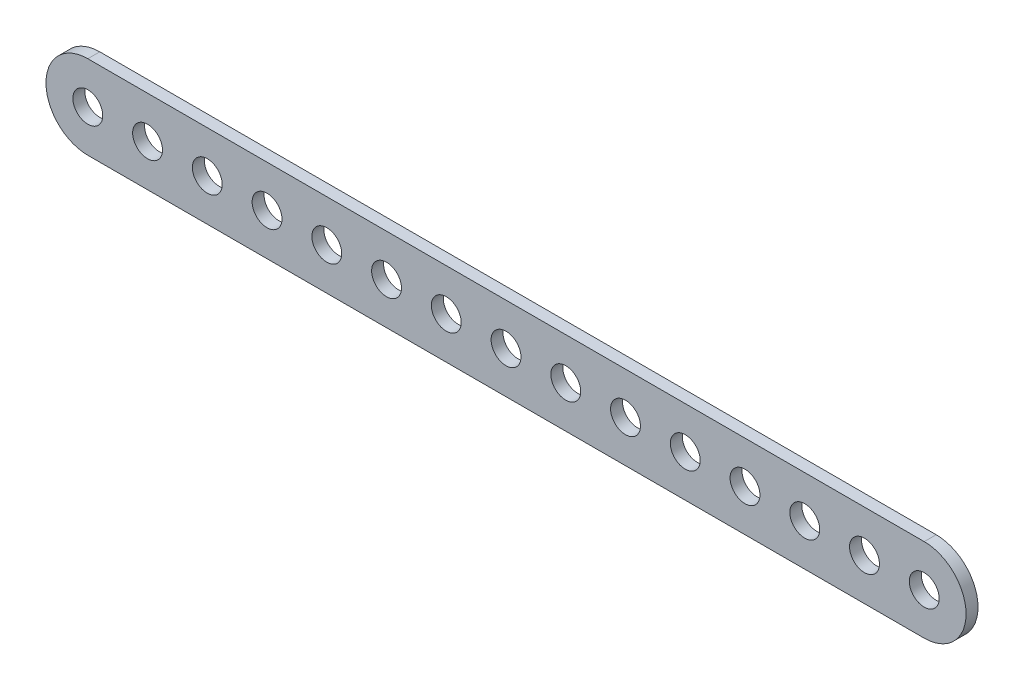
ISO-10303-21;
HEADER;
FILE_DESCRIPTION(('STEP AP214'),'2;1');
FILE_NAME('part.step','',(''),(''),'','','');
FILE_SCHEMA(('AUTOMOTIVE_DESIGN { 1 0 10303 214 1 1 1 1 }'));
ENDSEC;
DATA;
#1=APPLICATION_CONTEXT('core data for automotive mechanical design processes');
#2=APPLICATION_PROTOCOL_DEFINITION('international standard','automotive_design',2000,#1);
#3=PRODUCT_CONTEXT('',#1,'mechanical');
#4=PRODUCT('Part','Part','',(#3));
#5=PRODUCT_RELATED_PRODUCT_CATEGORY('part','',(#4));
#6=PRODUCT_DEFINITION_FORMATION('','',#4);
#7=PRODUCT_DEFINITION_CONTEXT('part definition',#1,'design');
#8=PRODUCT_DEFINITION('design','',#6,#7);
#9=PRODUCT_DEFINITION_SHAPE('','',#8);
#10=(LENGTH_UNIT() NAMED_UNIT(*) SI_UNIT(.MILLI.,.METRE.));
#11=(NAMED_UNIT(*) PLANE_ANGLE_UNIT() SI_UNIT($,.RADIAN.));
#12=(NAMED_UNIT(*) SI_UNIT($,.STERADIAN.) SOLID_ANGLE_UNIT());
#13=UNCERTAINTY_MEASURE_WITH_UNIT(LENGTH_MEASURE(1.E-05),#10,'distance_accuracy_value','');
#14=(GEOMETRIC_REPRESENTATION_CONTEXT(3) GLOBAL_UNCERTAINTY_ASSIGNED_CONTEXT((#13)) GLOBAL_UNIT_ASSIGNED_CONTEXT((#10,
#11,#12)) REPRESENTATION_CONTEXT('',''));
#15=CARTESIAN_POINT('',(0.,0.,0.));
#16=DIRECTION('',(0.,0.,1.));
#17=DIRECTION('',(1.,0.,0.));
#18=AXIS2_PLACEMENT_3D('',#15,#16,#17);
#19=CARTESIAN_POINT('',(0.,-35.,10.));
#20=DIRECTION('',(0.,1.,0.));
#21=DIRECTION('',(0.,0.,1.));
#22=AXIS2_PLACEMENT_3D('',#19,#20,#21);
#23=PLANE('',#22);
#24=DIRECTION('',(1.,0.,0.));
#25=VECTOR('',#24,1.);
#26=CARTESIAN_POINT('',(0.,-35.,0.));
#27=LINE('',#26,#25);
#28=CARTESIAN_POINT('',(0.,-35.,0.));
#29=VERTEX_POINT('',#28);
#30=CARTESIAN_POINT('',(700.,-35.,0.));
#31=VERTEX_POINT('',#30);
#32=EDGE_CURVE('E175',#29,#31,#27,.T.);
#33=ORIENTED_EDGE('',*,*,#32,.T.);
#34=DIRECTION('',(0.,0.,-1.));
#35=VECTOR('',#34,1.);
#36=CARTESIAN_POINT('',(700.,-35.,10.));
#37=LINE('',#36,#35);
#38=CARTESIAN_POINT('',(700.,-35.,10.));
#39=VERTEX_POINT('',#38);
#40=EDGE_CURVE('E11',#39,#31,#37,.T.);
#41=ORIENTED_EDGE('',*,*,#40,.F.);
#42=DIRECTION('',(1.,0.,0.));
#43=VECTOR('',#42,1.);
#44=CARTESIAN_POINT('',(0.,-35.,10.));
#45=LINE('',#44,#43);
#46=CARTESIAN_POINT('',(0.,-35.,10.));
#47=VERTEX_POINT('',#46);
#48=EDGE_CURVE('E96',#47,#39,#45,.T.);
#49=ORIENTED_EDGE('',*,*,#48,.F.);
#50=DIRECTION('',(0.,0.,-1.));
#51=VECTOR('',#50,1.);
#52=CARTESIAN_POINT('',(0.,-35.,10.));
#53=LINE('',#52,#51);
#54=EDGE_CURVE('E111',#47,#29,#53,.T.);
#55=ORIENTED_EDGE('',*,*,#54,.T.);
#56=EDGE_LOOP('',(#33,#41,#49,#55));
#57=FACE_BOUND('',#56,.T.);
#58=ADVANCED_FACE('F47',(#57),#23,.F.);
#59=CARTESIAN_POINT('',(700.,0.,10.));
#60=DIRECTION('',(0.,0.,-1.));
#61=DIRECTION('',(-1.,0.,0.));
#62=AXIS2_PLACEMENT_3D('',#59,#60,#61);
#63=CYLINDRICAL_SURFACE('',#62,35.);
#64=CARTESIAN_POINT('',(700.,0.,0.));
#65=DIRECTION('',(0.,0.,1.));
#66=DIRECTION('',(1.,0.,0.));
#67=AXIS2_PLACEMENT_3D('',#64,#65,#66);
#68=CIRCLE('',#67,35.);
#69=CARTESIAN_POINT('',(700.,35.,0.));
#70=VERTEX_POINT('',#69);
#71=EDGE_CURVE('E102',#31,#70,#68,.T.);
#72=ORIENTED_EDGE('',*,*,#71,.T.);
#73=DIRECTION('',(0.,0.,-1.));
#74=VECTOR('',#73,1.);
#75=CARTESIAN_POINT('',(700.,35.,10.));
#76=LINE('',#75,#74);
#77=CARTESIAN_POINT('',(700.,35.,10.));
#78=VERTEX_POINT('',#77);
#79=EDGE_CURVE('E57',#78,#70,#76,.T.);
#80=ORIENTED_EDGE('',*,*,#79,.F.);
#81=CARTESIAN_POINT('',(700.,0.,10.));
#82=DIRECTION('',(0.,0.,1.));
#83=DIRECTION('',(1.,0.,0.));
#84=AXIS2_PLACEMENT_3D('',#81,#82,#83);
#85=CIRCLE('',#84,35.);
#86=EDGE_CURVE('E91',#39,#78,#85,.T.);
#87=ORIENTED_EDGE('',*,*,#86,.F.);
#88=ORIENTED_EDGE('',*,*,#40,.T.);
#89=EDGE_LOOP('',(#72,#80,#87,#88));
#90=FACE_BOUND('',#89,.T.);
#91=ADVANCED_FACE('F101',(#90),#63,.T.);
#92=CARTESIAN_POINT('',(0.,35.,10.));
#93=DIRECTION('',(0.,1.,0.));
#94=DIRECTION('',(-1.,0.,0.));
#95=AXIS2_PLACEMENT_3D('',#92,#93,#94);
#96=PLANE('',#95);
#97=DIRECTION('',(1.,0.,0.));
#98=VECTOR('',#97,1.);
#99=CARTESIAN_POINT('',(0.,35.,0.));
#100=LINE('',#99,#98);
#101=CARTESIAN_POINT('',(0.,35.,0.));
#102=VERTEX_POINT('',#101);
#103=EDGE_CURVE('E181',#102,#70,#100,.T.);
#104=ORIENTED_EDGE('',*,*,#103,.F.);
#105=DIRECTION('',(0.,0.,-1.));
#106=VECTOR('',#105,1.);
#107=CARTESIAN_POINT('',(0.,35.,10.));
#108=LINE('',#107,#106);
#109=CARTESIAN_POINT('',(0.,35.,10.));
#110=VERTEX_POINT('',#109);
#111=EDGE_CURVE('E81',#110,#102,#108,.T.);
#112=ORIENTED_EDGE('',*,*,#111,.F.);
#113=DIRECTION('',(1.,0.,0.));
#114=VECTOR('',#113,1.);
#115=CARTESIAN_POINT('',(0.,35.,10.));
#116=LINE('',#115,#114);
#117=EDGE_CURVE('E94',#110,#78,#116,.T.);
#118=ORIENTED_EDGE('',*,*,#117,.T.);
#119=ORIENTED_EDGE('',*,*,#79,.T.);
#120=EDGE_LOOP('',(#104,#112,#118,#119));
#121=FACE_BOUND('',#120,.T.);
#122=ADVANCED_FACE('F107',(#121),#96,.T.);
#123=CARTESIAN_POINT('',(0.,0.,10.));
#124=DIRECTION('',(0.,0.,-1.));
#125=DIRECTION('',(-1.,0.,0.));
#126=AXIS2_PLACEMENT_3D('',#123,#124,#125);
#127=CYLINDRICAL_SURFACE('',#126,12.5);
#128=CARTESIAN_POINT('',(0.,0.,10.));
#129=DIRECTION('',(0.,0.,1.));
#130=DIRECTION('',(1.,0.,0.));
#131=AXIS2_PLACEMENT_3D('',#128,#129,#130);
#132=CIRCLE('',#131,12.5);
#133=CARTESIAN_POINT('',(12.5,0.,10.));
#134=VERTEX_POINT('',#133);
#135=EDGE_CURVE('E370',#134,#134,#132,.T.);
#136=ORIENTED_EDGE('',*,*,#135,.T.);
#137=EDGE_LOOP('',(#136));
#138=FACE_BOUND('',#137,.T.);
#139=CARTESIAN_POINT('',(0.,0.,0.));
#140=DIRECTION('',(0.,0.,1.));
#141=DIRECTION('',(1.,0.,0.));
#142=AXIS2_PLACEMENT_3D('',#139,#140,#141);
#143=CIRCLE('',#142,12.5);
#144=CARTESIAN_POINT('',(12.5,0.,0.));
#145=VERTEX_POINT('',#144);
#146=EDGE_CURVE('E171',#145,#145,#143,.T.);
#147=ORIENTED_EDGE('',*,*,#146,.F.);
#148=EDGE_LOOP('',(#147));
#149=FACE_BOUND('',#148,.T.);
#150=ADVANCED_FACE('F213',(#138,#149),#127,.F.);
#151=CARTESIAN_POINT('',(50.,0.,10.));
#152=DIRECTION('',(0.,0.,-1.));
#153=DIRECTION('',(-1.,0.,0.));
#154=AXIS2_PLACEMENT_3D('',#151,#152,#153);
#155=CYLINDRICAL_SURFACE('',#154,12.5);
#156=CARTESIAN_POINT('',(50.,0.,10.));
#157=DIRECTION('',(0.,0.,1.));
#158=DIRECTION('',(1.,0.,0.));
#159=AXIS2_PLACEMENT_3D('',#156,#157,#158);
#160=CIRCLE('',#159,12.5);
#161=CARTESIAN_POINT('',(62.5,0.,10.));
#162=VERTEX_POINT('',#161);
#163=EDGE_CURVE('E366',#162,#162,#160,.T.);
#164=ORIENTED_EDGE('',*,*,#163,.T.);
#165=EDGE_LOOP('',(#164));
#166=FACE_BOUND('',#165,.T.);
#167=CARTESIAN_POINT('',(50.,0.,0.));
#168=DIRECTION('',(0.,0.,1.));
#169=DIRECTION('',(1.,0.,0.));
#170=AXIS2_PLACEMENT_3D('',#167,#168,#169);
#171=CIRCLE('',#170,12.5);
#172=CARTESIAN_POINT('',(62.5,0.,0.));
#173=VERTEX_POINT('',#172);
#174=EDGE_CURVE('E167',#173,#173,#171,.T.);
#175=ORIENTED_EDGE('',*,*,#174,.F.);
#176=EDGE_LOOP('',(#175));
#177=FACE_BOUND('',#176,.T.);
#178=ADVANCED_FACE('F216',(#166,#177),#155,.F.);
#179=CARTESIAN_POINT('',(100.,0.,10.));
#180=DIRECTION('',(0.,0.,-1.));
#181=DIRECTION('',(-1.,0.,0.));
#182=AXIS2_PLACEMENT_3D('',#179,#180,#181);
#183=CYLINDRICAL_SURFACE('',#182,12.5);
#184=CARTESIAN_POINT('',(100.,0.,10.));
#185=DIRECTION('',(0.,0.,1.));
#186=DIRECTION('',(1.,0.,0.));
#187=AXIS2_PLACEMENT_3D('',#184,#185,#186);
#188=CIRCLE('',#187,12.5);
#189=CARTESIAN_POINT('',(112.5,0.,10.));
#190=VERTEX_POINT('',#189);
#191=EDGE_CURVE('E362',#190,#190,#188,.T.);
#192=ORIENTED_EDGE('',*,*,#191,.T.);
#193=EDGE_LOOP('',(#192));
#194=FACE_BOUND('',#193,.T.);
#195=CARTESIAN_POINT('',(100.,0.,0.));
#196=DIRECTION('',(0.,0.,1.));
#197=DIRECTION('',(1.,0.,0.));
#198=AXIS2_PLACEMENT_3D('',#195,#196,#197);
#199=CIRCLE('',#198,12.5);
#200=CARTESIAN_POINT('',(112.5,0.,0.));
#201=VERTEX_POINT('',#200);
#202=EDGE_CURVE('E163',#201,#201,#199,.T.);
#203=ORIENTED_EDGE('',*,*,#202,.F.);
#204=EDGE_LOOP('',(#203));
#205=FACE_BOUND('',#204,.T.);
#206=ADVANCED_FACE('F220',(#194,#205),#183,.F.);
#207=CARTESIAN_POINT('',(150.,0.,10.));
#208=DIRECTION('',(0.,0.,-1.));
#209=DIRECTION('',(-1.,0.,0.));
#210=AXIS2_PLACEMENT_3D('',#207,#208,#209);
#211=CYLINDRICAL_SURFACE('',#210,12.5);
#212=CARTESIAN_POINT('',(150.,0.,10.));
#213=DIRECTION('',(0.,0.,1.));
#214=DIRECTION('',(1.,0.,0.));
#215=AXIS2_PLACEMENT_3D('',#212,#213,#214);
#216=CIRCLE('',#215,12.5);
#217=CARTESIAN_POINT('',(162.5,0.,10.));
#218=VERTEX_POINT('',#217);
#219=EDGE_CURVE('E358',#218,#218,#216,.T.);
#220=ORIENTED_EDGE('',*,*,#219,.T.);
#221=EDGE_LOOP('',(#220));
#222=FACE_BOUND('',#221,.T.);
#223=CARTESIAN_POINT('',(150.,0.,0.));
#224=DIRECTION('',(0.,0.,1.));
#225=DIRECTION('',(1.,0.,0.));
#226=AXIS2_PLACEMENT_3D('',#223,#224,#225);
#227=CIRCLE('',#226,12.5);
#228=CARTESIAN_POINT('',(162.5,0.,0.));
#229=VERTEX_POINT('',#228);
#230=EDGE_CURVE('E159',#229,#229,#227,.T.);
#231=ORIENTED_EDGE('',*,*,#230,.F.);
#232=EDGE_LOOP('',(#231));
#233=FACE_BOUND('',#232,.T.);
#234=ADVANCED_FACE('F224',(#222,#233),#211,.F.);
#235=CARTESIAN_POINT('',(200.,0.,10.));
#236=DIRECTION('',(0.,0.,-1.));
#237=DIRECTION('',(-1.,0.,0.));
#238=AXIS2_PLACEMENT_3D('',#235,#236,#237);
#239=CYLINDRICAL_SURFACE('',#238,12.5);
#240=CARTESIAN_POINT('',(200.,0.,10.));
#241=DIRECTION('',(0.,0.,1.));
#242=DIRECTION('',(1.,0.,0.));
#243=AXIS2_PLACEMENT_3D('',#240,#241,#242);
#244=CIRCLE('',#243,12.5);
#245=CARTESIAN_POINT('',(212.5,0.,10.));
#246=VERTEX_POINT('',#245);
#247=EDGE_CURVE('E354',#246,#246,#244,.T.);
#248=ORIENTED_EDGE('',*,*,#247,.T.);
#249=EDGE_LOOP('',(#248));
#250=FACE_BOUND('',#249,.T.);
#251=CARTESIAN_POINT('',(200.,0.,0.));
#252=DIRECTION('',(0.,0.,1.));
#253=DIRECTION('',(1.,0.,0.));
#254=AXIS2_PLACEMENT_3D('',#251,#252,#253);
#255=CIRCLE('',#254,12.5);
#256=CARTESIAN_POINT('',(212.5,0.,0.));
#257=VERTEX_POINT('',#256);
#258=EDGE_CURVE('E155',#257,#257,#255,.T.);
#259=ORIENTED_EDGE('',*,*,#258,.F.);
#260=EDGE_LOOP('',(#259));
#261=FACE_BOUND('',#260,.T.);
#262=ADVANCED_FACE('F228',(#250,#261),#239,.F.);
#263=CARTESIAN_POINT('',(250.,0.,10.));
#264=DIRECTION('',(0.,0.,-1.));
#265=DIRECTION('',(-1.,0.,0.));
#266=AXIS2_PLACEMENT_3D('',#263,#264,#265);
#267=CYLINDRICAL_SURFACE('',#266,12.5);
#268=CARTESIAN_POINT('',(250.,0.,10.));
#269=DIRECTION('',(0.,0.,1.));
#270=DIRECTION('',(1.,0.,0.));
#271=AXIS2_PLACEMENT_3D('',#268,#269,#270);
#272=CIRCLE('',#271,12.5);
#273=CARTESIAN_POINT('',(262.5,0.,10.));
#274=VERTEX_POINT('',#273);
#275=EDGE_CURVE('E350',#274,#274,#272,.T.);
#276=ORIENTED_EDGE('',*,*,#275,.T.);
#277=EDGE_LOOP('',(#276));
#278=FACE_BOUND('',#277,.T.);
#279=CARTESIAN_POINT('',(250.,0.,0.));
#280=DIRECTION('',(0.,0.,1.));
#281=DIRECTION('',(1.,0.,0.));
#282=AXIS2_PLACEMENT_3D('',#279,#280,#281);
#283=CIRCLE('',#282,12.5);
#284=CARTESIAN_POINT('',(262.5,0.,0.));
#285=VERTEX_POINT('',#284);
#286=EDGE_CURVE('E151',#285,#285,#283,.T.);
#287=ORIENTED_EDGE('',*,*,#286,.F.);
#288=EDGE_LOOP('',(#287));
#289=FACE_BOUND('',#288,.T.);
#290=ADVANCED_FACE('F232',(#278,#289),#267,.F.);
#291=CARTESIAN_POINT('',(300.,0.,10.));
#292=DIRECTION('',(0.,0.,-1.));
#293=DIRECTION('',(-1.,0.,0.));
#294=AXIS2_PLACEMENT_3D('',#291,#292,#293);
#295=CYLINDRICAL_SURFACE('',#294,12.5);
#296=CARTESIAN_POINT('',(300.,0.,10.));
#297=DIRECTION('',(0.,0.,1.));
#298=DIRECTION('',(1.,0.,0.));
#299=AXIS2_PLACEMENT_3D('',#296,#297,#298);
#300=CIRCLE('',#299,12.5);
#301=CARTESIAN_POINT('',(312.5,0.,10.));
#302=VERTEX_POINT('',#301);
#303=EDGE_CURVE('E346',#302,#302,#300,.T.);
#304=ORIENTED_EDGE('',*,*,#303,.T.);
#305=EDGE_LOOP('',(#304));
#306=FACE_BOUND('',#305,.T.);
#307=CARTESIAN_POINT('',(300.,0.,0.));
#308=DIRECTION('',(0.,0.,1.));
#309=DIRECTION('',(1.,0.,0.));
#310=AXIS2_PLACEMENT_3D('',#307,#308,#309);
#311=CIRCLE('',#310,12.5);
#312=CARTESIAN_POINT('',(312.5,0.,0.));
#313=VERTEX_POINT('',#312);
#314=EDGE_CURVE('E147',#313,#313,#311,.T.);
#315=ORIENTED_EDGE('',*,*,#314,.F.);
#316=EDGE_LOOP('',(#315));
#317=FACE_BOUND('',#316,.T.);
#318=ADVANCED_FACE('F236',(#306,#317),#295,.F.);
#319=CARTESIAN_POINT('',(350.,0.,10.));
#320=DIRECTION('',(0.,0.,-1.));
#321=DIRECTION('',(-1.,0.,0.));
#322=AXIS2_PLACEMENT_3D('',#319,#320,#321);
#323=CYLINDRICAL_SURFACE('',#322,12.5);
#324=CARTESIAN_POINT('',(350.,0.,10.));
#325=DIRECTION('',(0.,0.,1.));
#326=DIRECTION('',(1.,0.,0.));
#327=AXIS2_PLACEMENT_3D('',#324,#325,#326);
#328=CIRCLE('',#327,12.5);
#329=CARTESIAN_POINT('',(362.5,0.,10.));
#330=VERTEX_POINT('',#329);
#331=EDGE_CURVE('E342',#330,#330,#328,.T.);
#332=ORIENTED_EDGE('',*,*,#331,.T.);
#333=EDGE_LOOP('',(#332));
#334=FACE_BOUND('',#333,.T.);
#335=CARTESIAN_POINT('',(350.,0.,0.));
#336=DIRECTION('',(0.,0.,1.));
#337=DIRECTION('',(1.,0.,0.));
#338=AXIS2_PLACEMENT_3D('',#335,#336,#337);
#339=CIRCLE('',#338,12.5);
#340=CARTESIAN_POINT('',(362.5,0.,0.));
#341=VERTEX_POINT('',#340);
#342=EDGE_CURVE('E143',#341,#341,#339,.T.);
#343=ORIENTED_EDGE('',*,*,#342,.F.);
#344=EDGE_LOOP('',(#343));
#345=FACE_BOUND('',#344,.T.);
#346=ADVANCED_FACE('F240',(#334,#345),#323,.F.);
#347=CARTESIAN_POINT('',(400.,0.,10.));
#348=DIRECTION('',(0.,0.,-1.));
#349=DIRECTION('',(-1.,0.,0.));
#350=AXIS2_PLACEMENT_3D('',#347,#348,#349);
#351=CYLINDRICAL_SURFACE('',#350,12.5);
#352=CARTESIAN_POINT('',(400.,0.,10.));
#353=DIRECTION('',(0.,0.,1.));
#354=DIRECTION('',(1.,0.,0.));
#355=AXIS2_PLACEMENT_3D('',#352,#353,#354);
#356=CIRCLE('',#355,12.5);
#357=CARTESIAN_POINT('',(412.5,0.,10.));
#358=VERTEX_POINT('',#357);
#359=EDGE_CURVE('E338',#358,#358,#356,.T.);
#360=ORIENTED_EDGE('',*,*,#359,.T.);
#361=EDGE_LOOP('',(#360));
#362=FACE_BOUND('',#361,.T.);
#363=CARTESIAN_POINT('',(400.,0.,0.));
#364=DIRECTION('',(0.,0.,1.));
#365=DIRECTION('',(1.,0.,0.));
#366=AXIS2_PLACEMENT_3D('',#363,#364,#365);
#367=CIRCLE('',#366,12.5);
#368=CARTESIAN_POINT('',(412.5,0.,0.));
#369=VERTEX_POINT('',#368);
#370=EDGE_CURVE('E139',#369,#369,#367,.T.);
#371=ORIENTED_EDGE('',*,*,#370,.F.);
#372=EDGE_LOOP('',(#371));
#373=FACE_BOUND('',#372,.T.);
#374=ADVANCED_FACE('F244',(#362,#373),#351,.F.);
#375=CARTESIAN_POINT('',(450.,0.,10.));
#376=DIRECTION('',(0.,0.,-1.));
#377=DIRECTION('',(-1.,0.,0.));
#378=AXIS2_PLACEMENT_3D('',#375,#376,#377);
#379=CYLINDRICAL_SURFACE('',#378,12.5);
#380=CARTESIAN_POINT('',(450.,0.,10.));
#381=DIRECTION('',(0.,0.,1.));
#382=DIRECTION('',(1.,0.,0.));
#383=AXIS2_PLACEMENT_3D('',#380,#381,#382);
#384=CIRCLE('',#383,12.5);
#385=CARTESIAN_POINT('',(462.5,0.,10.));
#386=VERTEX_POINT('',#385);
#387=EDGE_CURVE('E334',#386,#386,#384,.T.);
#388=ORIENTED_EDGE('',*,*,#387,.T.);
#389=EDGE_LOOP('',(#388));
#390=FACE_BOUND('',#389,.T.);
#391=CARTESIAN_POINT('',(450.,0.,0.));
#392=DIRECTION('',(0.,0.,1.));
#393=DIRECTION('',(1.,0.,0.));
#394=AXIS2_PLACEMENT_3D('',#391,#392,#393);
#395=CIRCLE('',#394,12.5);
#396=CARTESIAN_POINT('',(462.5,0.,0.));
#397=VERTEX_POINT('',#396);
#398=EDGE_CURVE('E135',#397,#397,#395,.T.);
#399=ORIENTED_EDGE('',*,*,#398,.F.);
#400=EDGE_LOOP('',(#399));
#401=FACE_BOUND('',#400,.T.);
#402=ADVANCED_FACE('F248',(#390,#401),#379,.F.);
#403=CARTESIAN_POINT('',(500.,0.,10.));
#404=DIRECTION('',(0.,0.,-1.));
#405=DIRECTION('',(-1.,0.,0.));
#406=AXIS2_PLACEMENT_3D('',#403,#404,#405);
#407=CYLINDRICAL_SURFACE('',#406,12.5);
#408=CARTESIAN_POINT('',(500.,0.,10.));
#409=DIRECTION('',(0.,0.,1.));
#410=DIRECTION('',(1.,0.,0.));
#411=AXIS2_PLACEMENT_3D('',#408,#409,#410);
#412=CIRCLE('',#411,12.5);
#413=CARTESIAN_POINT('',(512.5,0.,10.));
#414=VERTEX_POINT('',#413);
#415=EDGE_CURVE('E330',#414,#414,#412,.T.);
#416=ORIENTED_EDGE('',*,*,#415,.T.);
#417=EDGE_LOOP('',(#416));
#418=FACE_BOUND('',#417,.T.);
#419=CARTESIAN_POINT('',(500.,0.,0.));
#420=DIRECTION('',(0.,0.,1.));
#421=DIRECTION('',(1.,0.,0.));
#422=AXIS2_PLACEMENT_3D('',#419,#420,#421);
#423=CIRCLE('',#422,12.5);
#424=CARTESIAN_POINT('',(512.5,0.,0.));
#425=VERTEX_POINT('',#424);
#426=EDGE_CURVE('E131',#425,#425,#423,.T.);
#427=ORIENTED_EDGE('',*,*,#426,.F.);
#428=EDGE_LOOP('',(#427));
#429=FACE_BOUND('',#428,.T.);
#430=ADVANCED_FACE('F252',(#418,#429),#407,.F.);
#431=CARTESIAN_POINT('',(550.,0.,10.));
#432=DIRECTION('',(0.,0.,-1.));
#433=DIRECTION('',(-1.,0.,0.));
#434=AXIS2_PLACEMENT_3D('',#431,#432,#433);
#435=CYLINDRICAL_SURFACE('',#434,12.5);
#436=CARTESIAN_POINT('',(550.,0.,10.));
#437=DIRECTION('',(0.,0.,1.));
#438=DIRECTION('',(1.,0.,0.));
#439=AXIS2_PLACEMENT_3D('',#436,#437,#438);
#440=CIRCLE('',#439,12.5);
#441=CARTESIAN_POINT('',(562.5,0.,10.));
#442=VERTEX_POINT('',#441);
#443=EDGE_CURVE('E322',#442,#442,#440,.T.);
#444=ORIENTED_EDGE('',*,*,#443,.T.);
#445=EDGE_LOOP('',(#444));
#446=FACE_BOUND('',#445,.T.);
#447=CARTESIAN_POINT('',(550.,0.,0.));
#448=DIRECTION('',(0.,0.,1.));
#449=DIRECTION('',(1.,0.,0.));
#450=AXIS2_PLACEMENT_3D('',#447,#448,#449);
#451=CIRCLE('',#450,12.5);
#452=CARTESIAN_POINT('',(562.5,0.,0.));
#453=VERTEX_POINT('',#452);
#454=EDGE_CURVE('E127',#453,#453,#451,.T.);
#455=ORIENTED_EDGE('',*,*,#454,.F.);
#456=EDGE_LOOP('',(#455));
#457=FACE_BOUND('',#456,.T.);
#458=ADVANCED_FACE('F256',(#446,#457),#435,.F.);
#459=CARTESIAN_POINT('',(600.,0.,10.));
#460=DIRECTION('',(0.,0.,-1.));
#461=DIRECTION('',(-1.,0.,0.));
#462=AXIS2_PLACEMENT_3D('',#459,#460,#461);
#463=CYLINDRICAL_SURFACE('',#462,12.5);
#464=CARTESIAN_POINT('',(600.,0.,10.));
#465=DIRECTION('',(0.,0.,1.));
#466=DIRECTION('',(1.,0.,0.));
#467=AXIS2_PLACEMENT_3D('',#464,#465,#466);
#468=CIRCLE('',#467,12.5);
#469=CARTESIAN_POINT('',(612.5,0.,10.));
#470=VERTEX_POINT('',#469);
#471=EDGE_CURVE('E317',#470,#470,#468,.T.);
#472=ORIENTED_EDGE('',*,*,#471,.T.);
#473=EDGE_LOOP('',(#472));
#474=FACE_BOUND('',#473,.T.);
#475=CARTESIAN_POINT('',(600.,0.,0.));
#476=DIRECTION('',(0.,0.,1.));
#477=DIRECTION('',(1.,0.,0.));
#478=AXIS2_PLACEMENT_3D('',#475,#476,#477);
#479=CIRCLE('',#478,12.5);
#480=CARTESIAN_POINT('',(612.5,0.,0.));
#481=VERTEX_POINT('',#480);
#482=EDGE_CURVE('E123',#481,#481,#479,.T.);
#483=ORIENTED_EDGE('',*,*,#482,.F.);
#484=EDGE_LOOP('',(#483));
#485=FACE_BOUND('',#484,.T.);
#486=ADVANCED_FACE('F260',(#474,#485),#463,.F.);
#487=CARTESIAN_POINT('',(650.,0.,10.));
#488=DIRECTION('',(0.,0.,-1.));
#489=DIRECTION('',(-1.,0.,0.));
#490=AXIS2_PLACEMENT_3D('',#487,#488,#489);
#491=CYLINDRICAL_SURFACE('',#490,12.5);
#492=CARTESIAN_POINT('',(650.,0.,10.));
#493=DIRECTION('',(0.,0.,1.));
#494=DIRECTION('',(1.,0.,0.));
#495=AXIS2_PLACEMENT_3D('',#492,#493,#494);
#496=CIRCLE('',#495,12.5);
#497=CARTESIAN_POINT('',(662.5,0.,10.));
#498=VERTEX_POINT('',#497);
#499=EDGE_CURVE('E274',#498,#498,#496,.T.);
#500=ORIENTED_EDGE('',*,*,#499,.T.);
#501=EDGE_LOOP('',(#500));
#502=FACE_BOUND('',#501,.T.);
#503=CARTESIAN_POINT('',(650.,0.,0.));
#504=DIRECTION('',(0.,0.,1.));
#505=DIRECTION('',(1.,0.,0.));
#506=AXIS2_PLACEMENT_3D('',#503,#504,#505);
#507=CIRCLE('',#506,12.5);
#508=CARTESIAN_POINT('',(662.5,0.,0.));
#509=VERTEX_POINT('',#508);
#510=EDGE_CURVE('E119',#509,#509,#507,.T.);
#511=ORIENTED_EDGE('',*,*,#510,.F.);
#512=EDGE_LOOP('',(#511));
#513=FACE_BOUND('',#512,.T.);
#514=ADVANCED_FACE('F263',(#502,#513),#491,.F.);
#515=CARTESIAN_POINT('',(700.,0.,10.));
#516=DIRECTION('',(0.,0.,-1.));
#517=DIRECTION('',(-1.,0.,0.));
#518=AXIS2_PLACEMENT_3D('',#515,#516,#517);
#519=CYLINDRICAL_SURFACE('',#518,12.5);
#520=CARTESIAN_POINT('',(700.,0.,10.));
#521=DIRECTION('',(0.,0.,1.));
#522=DIRECTION('',(1.,0.,0.));
#523=AXIS2_PLACEMENT_3D('',#520,#521,#522);
#524=CIRCLE('',#523,12.5);
#525=CARTESIAN_POINT('',(712.5,0.,10.));
#526=VERTEX_POINT('',#525);
#527=EDGE_CURVE('E186',#526,#526,#524,.T.);
#528=ORIENTED_EDGE('',*,*,#527,.T.);
#529=EDGE_LOOP('',(#528));
#530=FACE_BOUND('',#529,.T.);
#531=CARTESIAN_POINT('',(700.,0.,0.));
#532=DIRECTION('',(0.,0.,1.));
#533=DIRECTION('',(1.,0.,0.));
#534=AXIS2_PLACEMENT_3D('',#531,#532,#533);
#535=CIRCLE('',#534,12.5);
#536=CARTESIAN_POINT('',(712.5,0.,0.));
#537=VERTEX_POINT('',#536);
#538=EDGE_CURVE('E115',#537,#537,#535,.T.);
#539=ORIENTED_EDGE('',*,*,#538,.F.);
#540=EDGE_LOOP('',(#539));
#541=FACE_BOUND('',#540,.T.);
#542=ADVANCED_FACE('F49',(#530,#541),#519,.F.);
#543=CARTESIAN_POINT('',(0.,0.,10.));
#544=DIRECTION('',(0.,0.,-1.));
#545=DIRECTION('',(-1.,0.,0.));
#546=AXIS2_PLACEMENT_3D('',#543,#544,#545);
#547=CYLINDRICAL_SURFACE('',#546,35.);
#548=CARTESIAN_POINT('',(0.,0.,0.));
#549=DIRECTION('',(0.,0.,1.));
#550=DIRECTION('',(1.,0.,0.));
#551=AXIS2_PLACEMENT_3D('',#548,#549,#550);
#552=CIRCLE('',#551,35.);
#553=EDGE_CURVE('E84',#102,#29,#552,.T.);
#554=ORIENTED_EDGE('',*,*,#553,.T.);
#555=ORIENTED_EDGE('',*,*,#54,.F.);
#556=CARTESIAN_POINT('',(0.,0.,10.));
#557=DIRECTION('',(0.,0.,1.));
#558=DIRECTION('',(1.,0.,0.));
#559=AXIS2_PLACEMENT_3D('',#556,#557,#558);
#560=CIRCLE('',#559,35.);
#561=EDGE_CURVE('E65',#110,#47,#560,.T.);
#562=ORIENTED_EDGE('',*,*,#561,.F.);
#563=ORIENTED_EDGE('',*,*,#111,.T.);
#564=EDGE_LOOP('',(#554,#555,#562,#563));
#565=FACE_BOUND('',#564,.T.);
#566=ADVANCED_FACE('F200',(#565),#547,.T.);
#567=CARTESIAN_POINT('',(0.,0.,10.));
#568=DIRECTION('',(0.,0.,1.));
#569=DIRECTION('',(1.,0.,0.));
#570=AXIS2_PLACEMENT_3D('',#567,#568,#569);
#571=PLANE('',#570);
#572=ORIENTED_EDGE('',*,*,#527,.F.);
#573=EDGE_LOOP('',(#572));
#574=FACE_BOUND('',#573,.T.);
#575=ORIENTED_EDGE('',*,*,#499,.F.);
#576=EDGE_LOOP('',(#575));
#577=FACE_BOUND('',#576,.T.);
#578=ORIENTED_EDGE('',*,*,#471,.F.);
#579=EDGE_LOOP('',(#578));
#580=FACE_BOUND('',#579,.T.);
#581=ORIENTED_EDGE('',*,*,#443,.F.);
#582=EDGE_LOOP('',(#581));
#583=FACE_BOUND('',#582,.T.);
#584=ORIENTED_EDGE('',*,*,#415,.F.);
#585=EDGE_LOOP('',(#584));
#586=FACE_BOUND('',#585,.T.);
#587=ORIENTED_EDGE('',*,*,#387,.F.);
#588=EDGE_LOOP('',(#587));
#589=FACE_BOUND('',#588,.T.);
#590=ORIENTED_EDGE('',*,*,#359,.F.);
#591=EDGE_LOOP('',(#590));
#592=FACE_BOUND('',#591,.T.);
#593=ORIENTED_EDGE('',*,*,#331,.F.);
#594=EDGE_LOOP('',(#593));
#595=FACE_BOUND('',#594,.T.);
#596=ORIENTED_EDGE('',*,*,#303,.F.);
#597=EDGE_LOOP('',(#596));
#598=FACE_BOUND('',#597,.T.);
#599=ORIENTED_EDGE('',*,*,#275,.F.);
#600=EDGE_LOOP('',(#599));
#601=FACE_BOUND('',#600,.T.);
#602=ORIENTED_EDGE('',*,*,#247,.F.);
#603=EDGE_LOOP('',(#602));
#604=FACE_BOUND('',#603,.T.);
#605=ORIENTED_EDGE('',*,*,#219,.F.);
#606=EDGE_LOOP('',(#605));
#607=FACE_BOUND('',#606,.T.);
#608=ORIENTED_EDGE('',*,*,#191,.F.);
#609=EDGE_LOOP('',(#608));
#610=FACE_BOUND('',#609,.T.);
#611=ORIENTED_EDGE('',*,*,#163,.F.);
#612=EDGE_LOOP('',(#611));
#613=FACE_BOUND('',#612,.T.);
#614=ORIENTED_EDGE('',*,*,#135,.F.);
#615=EDGE_LOOP('',(#614));
#616=FACE_BOUND('',#615,.T.);
#617=ORIENTED_EDGE('',*,*,#48,.T.);
#618=ORIENTED_EDGE('',*,*,#86,.T.);
#619=ORIENTED_EDGE('',*,*,#117,.F.);
#620=ORIENTED_EDGE('',*,*,#561,.T.);
#621=EDGE_LOOP('',(#617,#618,#619,#620));
#622=FACE_BOUND('',#621,.T.);
#623=ADVANCED_FACE('F92',(#574,#577,#580,#583,#586,#589,#592,#595,#598,#601,#604,#607,#610,#613,
#616,#622),#571,.T.);
#624=CARTESIAN_POINT('',(0.,0.,0.));
#625=DIRECTION('',(0.,0.,1.));
#626=DIRECTION('',(1.,0.,0.));
#627=AXIS2_PLACEMENT_3D('',#624,#625,#626);
#628=PLANE('',#627);
#629=ORIENTED_EDGE('',*,*,#538,.T.);
#630=EDGE_LOOP('',(#629));
#631=FACE_BOUND('',#630,.T.);
#632=ORIENTED_EDGE('',*,*,#510,.T.);
#633=EDGE_LOOP('',(#632));
#634=FACE_BOUND('',#633,.T.);
#635=ORIENTED_EDGE('',*,*,#482,.T.);
#636=EDGE_LOOP('',(#635));
#637=FACE_BOUND('',#636,.T.);
#638=ORIENTED_EDGE('',*,*,#454,.T.);
#639=EDGE_LOOP('',(#638));
#640=FACE_BOUND('',#639,.T.);
#641=ORIENTED_EDGE('',*,*,#426,.T.);
#642=EDGE_LOOP('',(#641));
#643=FACE_BOUND('',#642,.T.);
#644=ORIENTED_EDGE('',*,*,#398,.T.);
#645=EDGE_LOOP('',(#644));
#646=FACE_BOUND('',#645,.T.);
#647=ORIENTED_EDGE('',*,*,#370,.T.);
#648=EDGE_LOOP('',(#647));
#649=FACE_BOUND('',#648,.T.);
#650=ORIENTED_EDGE('',*,*,#342,.T.);
#651=EDGE_LOOP('',(#650));
#652=FACE_BOUND('',#651,.T.);
#653=ORIENTED_EDGE('',*,*,#314,.T.);
#654=EDGE_LOOP('',(#653));
#655=FACE_BOUND('',#654,.T.);
#656=ORIENTED_EDGE('',*,*,#286,.T.);
#657=EDGE_LOOP('',(#656));
#658=FACE_BOUND('',#657,.T.);
#659=ORIENTED_EDGE('',*,*,#258,.T.);
#660=EDGE_LOOP('',(#659));
#661=FACE_BOUND('',#660,.T.);
#662=ORIENTED_EDGE('',*,*,#230,.T.);
#663=EDGE_LOOP('',(#662));
#664=FACE_BOUND('',#663,.T.);
#665=ORIENTED_EDGE('',*,*,#202,.T.);
#666=EDGE_LOOP('',(#665));
#667=FACE_BOUND('',#666,.T.);
#668=ORIENTED_EDGE('',*,*,#174,.T.);
#669=EDGE_LOOP('',(#668));
#670=FACE_BOUND('',#669,.T.);
#671=ORIENTED_EDGE('',*,*,#146,.T.);
#672=EDGE_LOOP('',(#671));
#673=FACE_BOUND('',#672,.T.);
#674=ORIENTED_EDGE('',*,*,#32,.F.);
#675=ORIENTED_EDGE('',*,*,#553,.F.);
#676=ORIENTED_EDGE('',*,*,#103,.T.);
#677=ORIENTED_EDGE('',*,*,#71,.F.);
#678=EDGE_LOOP('',(#674,#675,#676,#677));
#679=FACE_BOUND('',#678,.T.);
#680=ADVANCED_FACE('F193',(#631,#634,#637,#640,#643,#646,#649,#652,#655,#658,#661,#664,#667,
#670,#673,#679),#628,.F.);
#681=CLOSED_SHELL('',(#58,#91,#122,#150,#178,#206,#234,#262,#290,#318,#346,#374,#402,#430,#458,
#486,#514,#542,#566,#623,#680));
#682=MANIFOLD_SOLID_BREP('B2',#681);
#683=ADVANCED_BREP_SHAPE_REPRESENTATION('',(#18,#682),#14);
#684=SHAPE_DEFINITION_REPRESENTATION(#9,#683);
ENDSEC;
END-ISO-10303-21;
